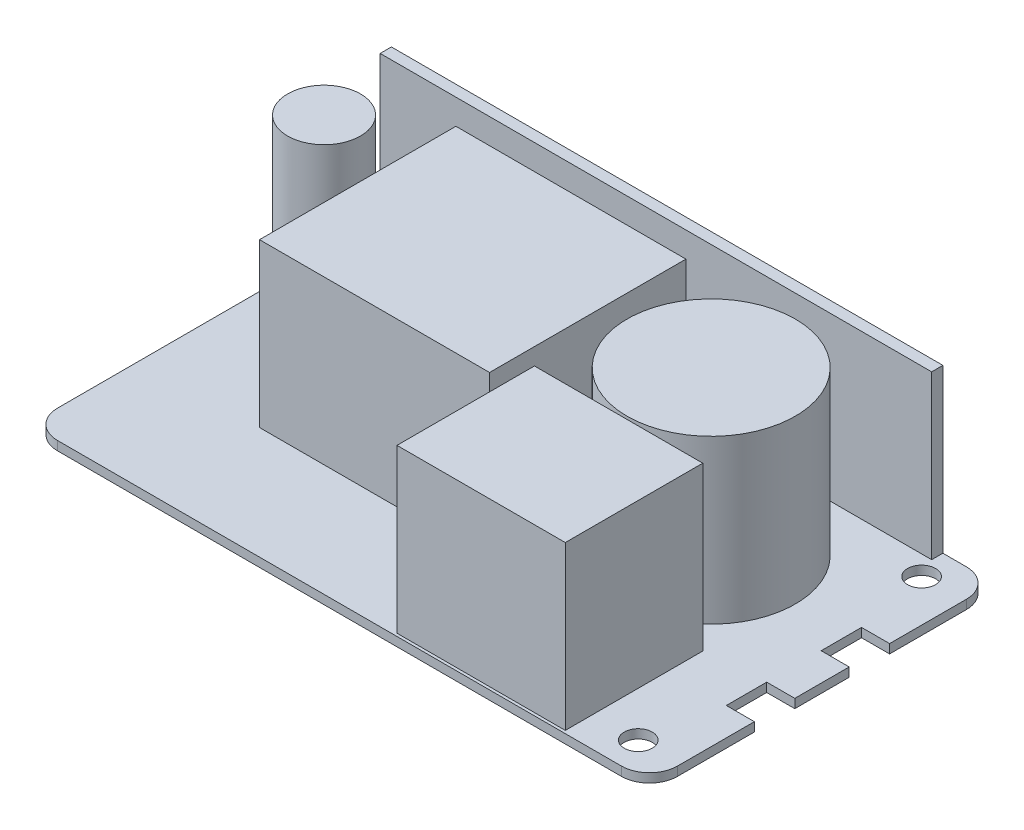
ISO-10303-21;
HEADER;
FILE_DESCRIPTION(('STEP AP214'),'2;1');
FILE_NAME('part.step','',(''),(''),'','','');
FILE_SCHEMA(('AUTOMOTIVE_DESIGN { 1 0 10303 214 1 1 1 1 }'));
ENDSEC;
DATA;
#1=APPLICATION_CONTEXT('core data for automotive mechanical design processes');
#2=APPLICATION_PROTOCOL_DEFINITION('international standard','automotive_design',2000,#1);
#3=PRODUCT_CONTEXT('',#1,'mechanical');
#4=PRODUCT('Part','Part','',(#3));
#5=PRODUCT_RELATED_PRODUCT_CATEGORY('part','',(#4));
#6=PRODUCT_DEFINITION_FORMATION('','',#4);
#7=PRODUCT_DEFINITION_CONTEXT('part definition',#1,'design');
#8=PRODUCT_DEFINITION('design','',#6,#7);
#9=PRODUCT_DEFINITION_SHAPE('','',#8);
#10=(LENGTH_UNIT() NAMED_UNIT(*) SI_UNIT(.MILLI.,.METRE.));
#11=(NAMED_UNIT(*) PLANE_ANGLE_UNIT() SI_UNIT($,.RADIAN.));
#12=(NAMED_UNIT(*) SI_UNIT($,.STERADIAN.) SOLID_ANGLE_UNIT());
#13=UNCERTAINTY_MEASURE_WITH_UNIT(LENGTH_MEASURE(1.E-05),#10,'distance_accuracy_value','');
#14=(GEOMETRIC_REPRESENTATION_CONTEXT(3) GLOBAL_UNCERTAINTY_ASSIGNED_CONTEXT((#13)) GLOBAL_UNIT_ASSIGNED_CONTEXT((#10,
#11,#12)) REPRESENTATION_CONTEXT('',''));
#15=CARTESIAN_POINT('',(0.,0.,0.));
#16=DIRECTION('',(0.,0.,1.));
#17=DIRECTION('',(1.,0.,0.));
#18=AXIS2_PLACEMENT_3D('',#15,#16,#17);
#19=CARTESIAN_POINT('',(50.25,1.6,-25.75));
#20=DIRECTION('',(0.,-1.,0.));
#21=DIRECTION('',(0.,0.,-1.));
#22=AXIS2_PLACEMENT_3D('',#19,#20,#21);
#23=PLANE('',#22);
#24=CARTESIAN_POINT('',(-47.75,1.6,-14.25));
#25=DIRECTION('',(0.,-1.,0.));
#26=DIRECTION('',(0.,0.,-1.));
#27=AXIS2_PLACEMENT_3D('',#24,#25,#26);
#28=CIRCLE('',#27,6.5);
#29=CARTESIAN_POINT('',(-47.75,1.6,-20.75));
#30=VERTEX_POINT('',#29);
#31=EDGE_CURVE('E13',#30,#30,#28,.F.);
#32=ORIENTED_EDGE('',*,*,#31,.F.);
#33=EDGE_LOOP('',(#32));
#34=FACE_BOUND('',#33,.T.);
#35=DIRECTION('',(0.,0.,-1.));
#36=VECTOR('',#35,1.);
#37=CARTESIAN_POINT('',(39.75,1.6,5.75000000000001));
#38=LINE('',#37,#36);
#39=CARTESIAN_POINT('',(39.75,1.6,30.25));
#40=VERTEX_POINT('',#39);
#41=CARTESIAN_POINT('',(39.75,1.6,5.75000000000001));
#42=VERTEX_POINT('',#41);
#43=EDGE_CURVE('E255',#40,#42,#38,.T.);
#44=ORIENTED_EDGE('',*,*,#43,.F.);
#45=DIRECTION('',(1.,0.,0.));
#46=VECTOR('',#45,1.);
#47=CARTESIAN_POINT('',(9.75000000000001,1.6,30.25));
#48=LINE('',#47,#46);
#49=CARTESIAN_POINT('',(9.75000000000001,1.6,30.25));
#50=VERTEX_POINT('',#49);
#51=EDGE_CURVE('E268',#50,#40,#48,.T.);
#52=ORIENTED_EDGE('',*,*,#51,.F.);
#53=DIRECTION('',(0.,0.,1.));
#54=VECTOR('',#53,1.);
#55=CARTESIAN_POINT('',(9.75000000000001,1.6,5.75000000000001));
#56=LINE('',#55,#54);
#57=CARTESIAN_POINT('',(9.75,1.6,5.75000000000001));
#58=VERTEX_POINT('',#57);
#59=EDGE_CURVE('E277',#58,#50,#56,.T.);
#60=ORIENTED_EDGE('',*,*,#59,.F.);
#61=DIRECTION('',(-1.,0.,0.));
#62=VECTOR('',#61,1.);
#63=CARTESIAN_POINT('',(9.75000000000001,1.6,5.75000000000001));
#64=LINE('',#63,#62);
#65=EDGE_CURVE('E258',#42,#58,#64,.T.);
#66=ORIENTED_EDGE('',*,*,#65,.F.);
#67=EDGE_LOOP('',(#44,#52,#60,#66));
#68=FACE_BOUND('',#67,.T.);
#69=CARTESIAN_POINT('',(47.75,1.6,25.25));
#70=DIRECTION('',(0.,1.,0.));
#71=DIRECTION('',(0.,0.,-1.));
#72=AXIS2_PLACEMENT_3D('',#69,#70,#71);
#73=CIRCLE('',#72,2.5);
#74=CARTESIAN_POINT('',(47.75,1.6,22.75));
#75=VERTEX_POINT('',#74);
#76=EDGE_CURVE('E328',#75,#75,#73,.T.);
#77=ORIENTED_EDGE('',*,*,#76,.F.);
#78=EDGE_LOOP('',(#77));
#79=FACE_BOUND('',#78,.T.);
#80=CARTESIAN_POINT('',(47.75,1.6,-25.25));
#81=DIRECTION('',(0.,1.,0.));
#82=DIRECTION('',(0.,0.,1.));
#83=AXIS2_PLACEMENT_3D('',#80,#81,#82);
#84=CIRCLE('',#83,2.5);
#85=CARTESIAN_POINT('',(47.75,1.6,-22.75));
#86=VERTEX_POINT('',#85);
#87=EDGE_CURVE('E333',#86,#86,#84,.T.);
#88=ORIENTED_EDGE('',*,*,#87,.F.);
#89=EDGE_LOOP('',(#88));
#90=FACE_BOUND('',#89,.T.);
#91=CARTESIAN_POINT('',(25.75,1.6,-9.74999999999999));
#92=DIRECTION('',(0.,-1.,0.));
#93=DIRECTION('',(0.,0.,-1.));
#94=AXIS2_PLACEMENT_3D('',#91,#92,#93);
#95=CIRCLE('',#94,15.);
#96=CARTESIAN_POINT('',(25.75,1.6,-24.75));
#97=VERTEX_POINT('',#96);
#98=EDGE_CURVE('E456',#97,#97,#95,.F.);
#99=ORIENTED_EDGE('',*,*,#98,.F.);
#100=EDGE_LOOP('',(#99));
#101=FACE_BOUND('',#100,.T.);
#102=DIRECTION('',(0.,0.,-1.));
#103=VECTOR('',#102,1.);
#104=CARTESIAN_POINT('',(46.05,1.6,-30.75));
#105=LINE('',#104,#103);
#106=CARTESIAN_POINT('',(46.05,1.6,-28.75));
#107=VERTEX_POINT('',#106);
#108=CARTESIAN_POINT('',(46.05,1.6,-30.75));
#109=VERTEX_POINT('',#108);
#110=EDGE_CURVE('E293',#107,#109,#105,.T.);
#111=ORIENTED_EDGE('',*,*,#110,.F.);
#112=DIRECTION('',(1.,0.,0.));
#113=VECTOR('',#112,1.);
#114=CARTESIAN_POINT('',(-52.25,1.6,-28.75));
#115=LINE('',#114,#113);
#116=CARTESIAN_POINT('',(-52.25,1.6,-28.75));
#117=VERTEX_POINT('',#116);
#118=EDGE_CURVE('E298',#117,#107,#115,.T.);
#119=ORIENTED_EDGE('',*,*,#118,.F.);
#120=DIRECTION('',(0.,0.,1.));
#121=VECTOR('',#120,1.);
#122=CARTESIAN_POINT('',(-52.25,1.6,-25.75));
#123=LINE('',#122,#121);
#124=CARTESIAN_POINT('',(-52.25,1.6,-30.3325756949558));
#125=VERTEX_POINT('',#124);
#126=EDGE_CURVE('E54',#125,#117,#123,.T.);
#127=ORIENTED_EDGE('',*,*,#126,.F.);
#128=CARTESIAN_POINT('',(-50.25,1.6,-25.75));
#129=DIRECTION('',(0.,1.,0.));
#130=DIRECTION('',(0.,0.,1.));
#131=AXIS2_PLACEMENT_3D('',#128,#129,#130);
#132=CIRCLE('',#131,5.);
#133=CARTESIAN_POINT('',(-55.25,1.6,-25.75));
#134=VERTEX_POINT('',#133);
#135=EDGE_CURVE('E347',#125,#134,#132,.T.);
#136=ORIENTED_EDGE('',*,*,#135,.T.);
#137=DIRECTION('',(0.,0.,1.));
#138=VECTOR('',#137,1.);
#139=CARTESIAN_POINT('',(-55.25,1.6,-25.75));
#140=LINE('',#139,#138);
#141=CARTESIAN_POINT('',(-55.25,1.6,25.75));
#142=VERTEX_POINT('',#141);
#143=EDGE_CURVE('E351',#134,#142,#140,.T.);
#144=ORIENTED_EDGE('',*,*,#143,.T.);
#145=CARTESIAN_POINT('',(-50.25,1.6,25.75));
#146=DIRECTION('',(0.,1.,0.));
#147=DIRECTION('',(0.,0.,1.));
#148=AXIS2_PLACEMENT_3D('',#145,#146,#147);
#149=CIRCLE('',#148,5.);
#150=CARTESIAN_POINT('',(-50.25,1.6,30.75));
#151=VERTEX_POINT('',#150);
#152=EDGE_CURVE('E353',#142,#151,#149,.T.);
#153=ORIENTED_EDGE('',*,*,#152,.T.);
#154=DIRECTION('',(1.,0.,0.));
#155=VECTOR('',#154,1.);
#156=CARTESIAN_POINT('',(-50.25,1.6,30.75));
#157=LINE('',#156,#155);
#158=CARTESIAN_POINT('',(50.25,1.6,30.75));
#159=VERTEX_POINT('',#158);
#160=EDGE_CURVE('E355',#151,#159,#157,.T.);
#161=ORIENTED_EDGE('',*,*,#160,.T.);
#162=CARTESIAN_POINT('',(50.25,1.6,25.75));
#163=DIRECTION('',(0.,1.,0.));
#164=DIRECTION('',(0.,0.,1.));
#165=AXIS2_PLACEMENT_3D('',#162,#163,#164);
#166=CIRCLE('',#165,5.);
#167=CARTESIAN_POINT('',(55.25,1.6,25.75));
#168=VERTEX_POINT('',#167);
#169=EDGE_CURVE('E357',#159,#168,#166,.T.);
#170=ORIENTED_EDGE('',*,*,#169,.T.);
#171=DIRECTION('',(0.,0.,-1.));
#172=VECTOR('',#171,1.);
#173=CARTESIAN_POINT('',(55.25,1.6,12.05));
#174=LINE('',#173,#172);
#175=CARTESIAN_POINT('',(55.25,1.6,12.05));
#176=VERTEX_POINT('',#175);
#177=EDGE_CURVE('E359',#168,#176,#174,.T.);
#178=ORIENTED_EDGE('',*,*,#177,.T.);
#179=DIRECTION('',(-1.,0.,0.));
#180=VECTOR('',#179,1.);
#181=CARTESIAN_POINT('',(55.25,1.6,12.05));
#182=LINE('',#181,#180);
#183=CARTESIAN_POINT('',(50.25,1.6,12.05));
#184=VERTEX_POINT('',#183);
#185=EDGE_CURVE('E361',#176,#184,#182,.T.);
#186=ORIENTED_EDGE('',*,*,#185,.T.);
#187=DIRECTION('',(0.,0.,-1.));
#188=VECTOR('',#187,1.);
#189=CARTESIAN_POINT('',(50.25,1.6,12.05));
#190=LINE('',#189,#188);
#191=CARTESIAN_POINT('',(50.25,1.6,4.85));
#192=VERTEX_POINT('',#191);
#193=EDGE_CURVE('E363',#184,#192,#190,.T.);
#194=ORIENTED_EDGE('',*,*,#193,.T.);
#195=DIRECTION('',(1.,0.,0.));
#196=VECTOR('',#195,1.);
#197=CARTESIAN_POINT('',(50.25,1.6,4.85));
#198=LINE('',#197,#196);
#199=CARTESIAN_POINT('',(55.25,1.6,4.85));
#200=VERTEX_POINT('',#199);
#201=EDGE_CURVE('E365',#192,#200,#198,.T.);
#202=ORIENTED_EDGE('',*,*,#201,.T.);
#203=DIRECTION('',(0.,0.,-1.));
#204=VECTOR('',#203,1.);
#205=CARTESIAN_POINT('',(55.25,1.6,-4.85));
#206=LINE('',#205,#204);
#207=CARTESIAN_POINT('',(55.25,1.6,-4.85));
#208=VERTEX_POINT('',#207);
#209=EDGE_CURVE('E367',#200,#208,#206,.T.);
#210=ORIENTED_EDGE('',*,*,#209,.T.);
#211=DIRECTION('',(-1.,0.,0.));
#212=VECTOR('',#211,1.);
#213=CARTESIAN_POINT('',(50.25,1.6,-4.85));
#214=LINE('',#213,#212);
#215=CARTESIAN_POINT('',(50.25,1.6,-4.85));
#216=VERTEX_POINT('',#215);
#217=EDGE_CURVE('E369',#208,#216,#214,.T.);
#218=ORIENTED_EDGE('',*,*,#217,.T.);
#219=DIRECTION('',(0.,0.,-1.));
#220=VECTOR('',#219,1.);
#221=CARTESIAN_POINT('',(50.25,1.6,-12.05));
#222=LINE('',#221,#220);
#223=CARTESIAN_POINT('',(50.25,1.6,-12.05));
#224=VERTEX_POINT('',#223);
#225=EDGE_CURVE('E371',#216,#224,#222,.T.);
#226=ORIENTED_EDGE('',*,*,#225,.T.);
#227=DIRECTION('',(1.,0.,0.));
#228=VECTOR('',#227,1.);
#229=CARTESIAN_POINT('',(55.25,1.6,-12.05));
#230=LINE('',#229,#228);
#231=CARTESIAN_POINT('',(55.25,1.6,-12.05));
#232=VERTEX_POINT('',#231);
#233=EDGE_CURVE('E373',#224,#232,#230,.T.);
#234=ORIENTED_EDGE('',*,*,#233,.T.);
#235=DIRECTION('',(0.,0.,-1.));
#236=VECTOR('',#235,1.);
#237=CARTESIAN_POINT('',(55.25,1.6,-25.75));
#238=LINE('',#237,#236);
#239=CARTESIAN_POINT('',(55.25,1.6,-25.75));
#240=VERTEX_POINT('',#239);
#241=EDGE_CURVE('E375',#232,#240,#238,.T.);
#242=ORIENTED_EDGE('',*,*,#241,.T.);
#243=CARTESIAN_POINT('',(50.25,1.6,-25.75));
#244=DIRECTION('',(0.,1.,0.));
#245=DIRECTION('',(0.,0.,-1.));
#246=AXIS2_PLACEMENT_3D('',#243,#244,#245);
#247=CIRCLE('',#246,4.99999999999999);
#248=CARTESIAN_POINT('',(50.25,1.6,-30.75));
#249=VERTEX_POINT('',#248);
#250=EDGE_CURVE('E341',#240,#249,#247,.T.);
#251=ORIENTED_EDGE('',*,*,#250,.T.);
#252=DIRECTION('',(-1.,0.,0.));
#253=VECTOR('',#252,1.);
#254=CARTESIAN_POINT('',(-50.25,1.6,-30.75));
#255=LINE('',#254,#253);
#256=EDGE_CURVE('E344',#249,#109,#255,.T.);
#257=ORIENTED_EDGE('',*,*,#256,.T.);
#258=EDGE_LOOP('',(#111,#119,#127,#136,#144,#153,#161,#170,#178,#186,#194,#202,#210,#218,#226,
#234,#242,#251,#257));
#259=FACE_BOUND('',#258,.T.);
#260=DIRECTION('',(0.,0.,-1.));
#261=VECTOR('',#260,1.);
#262=CARTESIAN_POINT('',(6.74999999999999,1.6,-24.25));
#263=LINE('',#262,#261);
#264=CARTESIAN_POINT('',(6.75,1.6,10.75));
#265=VERTEX_POINT('',#264);
#266=CARTESIAN_POINT('',(6.74999999999999,1.6,-24.25));
#267=VERTEX_POINT('',#266);
#268=EDGE_CURVE('E254',#265,#267,#263,.T.);
#269=ORIENTED_EDGE('',*,*,#268,.F.);
#270=DIRECTION('',(1.,0.,0.));
#271=VECTOR('',#270,1.);
#272=CARTESIAN_POINT('',(-34.25,1.6,10.75));
#273=LINE('',#272,#271);
#274=CARTESIAN_POINT('',(-34.25,1.6,10.75));
#275=VERTEX_POINT('',#274);
#276=EDGE_CURVE('E251',#275,#265,#273,.T.);
#277=ORIENTED_EDGE('',*,*,#276,.F.);
#278=DIRECTION('',(0.,0.,1.));
#279=VECTOR('',#278,1.);
#280=CARTESIAN_POINT('',(-34.25,1.6,-24.25));
#281=LINE('',#280,#279);
#282=CARTESIAN_POINT('',(-34.25,1.6,-24.25));
#283=VERTEX_POINT('',#282);
#284=EDGE_CURVE('E66',#283,#275,#281,.T.);
#285=ORIENTED_EDGE('',*,*,#284,.F.);
#286=DIRECTION('',(-1.,0.,0.));
#287=VECTOR('',#286,1.);
#288=CARTESIAN_POINT('',(-34.25,1.6,-24.25));
#289=LINE('',#288,#287);
#290=EDGE_CURVE('E61',#267,#283,#289,.T.);
#291=ORIENTED_EDGE('',*,*,#290,.F.);
#292=EDGE_LOOP('',(#269,#277,#285,#291));
#293=FACE_BOUND('',#292,.T.);
#294=ADVANCED_FACE('F46',(#34,#68,#79,#90,#101,#259,#293),#23,.F.);
#295=CARTESIAN_POINT('',(50.25,1.6,-25.75));
#296=DIRECTION('',(0.,-1.,0.));
#297=DIRECTION('',(0.,0.,-1.));
#298=AXIS2_PLACEMENT_3D('',#295,#296,#297);
#299=CYLINDRICAL_SURFACE('',#298,4.99999999999999);
#300=CARTESIAN_POINT('',(50.25,0.,-25.75));
#301=DIRECTION('',(0.,1.,0.));
#302=DIRECTION('',(0.,0.,-1.));
#303=AXIS2_PLACEMENT_3D('',#300,#301,#302);
#304=CIRCLE('',#303,4.99999999999999);
#305=CARTESIAN_POINT('',(55.25,0.,-25.75));
#306=VERTEX_POINT('',#305);
#307=CARTESIAN_POINT('',(50.25,0.,-30.75));
#308=VERTEX_POINT('',#307);
#309=EDGE_CURVE('E332',#306,#308,#304,.T.);
#310=ORIENTED_EDGE('',*,*,#309,.T.);
#311=DIRECTION('',(0.,-1.,0.));
#312=VECTOR('',#311,1.);
#313=CARTESIAN_POINT('',(50.25,1.6,-30.75));
#314=LINE('',#313,#312);
#315=EDGE_CURVE('E453',#249,#308,#314,.T.);
#316=ORIENTED_EDGE('',*,*,#315,.F.);
#317=ORIENTED_EDGE('',*,*,#250,.F.);
#318=DIRECTION('',(0.,-1.,0.));
#319=VECTOR('',#318,1.);
#320=CARTESIAN_POINT('',(55.25,1.6,-25.75));
#321=LINE('',#320,#319);
#322=EDGE_CURVE('E377',#240,#306,#321,.T.);
#323=ORIENTED_EDGE('',*,*,#322,.T.);
#324=EDGE_LOOP('',(#310,#316,#317,#323));
#325=FACE_BOUND('',#324,.T.);
#326=ADVANCED_FACE('F48',(#325),#299,.T.);
#327=CARTESIAN_POINT('',(-50.25,1.6,-30.75));
#328=DIRECTION('',(0.,0.,1.));
#329=DIRECTION('',(1.,0.,0.));
#330=AXIS2_PLACEMENT_3D('',#327,#328,#329);
#331=PLANE('',#330);
#332=DIRECTION('',(-1.,0.,0.));
#333=VECTOR('',#332,1.);
#334=CARTESIAN_POINT('',(-50.25,0.,-30.75));
#335=LINE('',#334,#333);
#336=CARTESIAN_POINT('',(-50.25,0.,-30.75));
#337=VERTEX_POINT('',#336);
#338=EDGE_CURVE('E380',#308,#337,#335,.T.);
#339=ORIENTED_EDGE('',*,*,#338,.T.);
#340=DIRECTION('',(0.,-1.,0.));
#341=VECTOR('',#340,1.);
#342=CARTESIAN_POINT('',(-50.25,1.6,-30.75));
#343=LINE('',#342,#341);
#344=CARTESIAN_POINT('',(-50.25,1.6,-30.75));
#345=VERTEX_POINT('',#344);
#346=EDGE_CURVE('E450',#345,#337,#343,.T.);
#347=ORIENTED_EDGE('',*,*,#346,.F.);
#348=DIRECTION('',(-1.,0.,0.));
#349=VECTOR('',#348,1.);
#350=CARTESIAN_POINT('',(-52.25,1.6,-30.75));
#351=LINE('',#350,#349);
#352=CARTESIAN_POINT('',(-52.25,1.6,-30.75));
#353=VERTEX_POINT('',#352);
#354=EDGE_CURVE('E307',#345,#353,#351,.T.);
#355=ORIENTED_EDGE('',*,*,#354,.T.);
#356=DIRECTION('',(0.,-1.,0.));
#357=VECTOR('',#356,1.);
#358=CARTESIAN_POINT('',(-52.25,30.6,-30.75));
#359=LINE('',#358,#357);
#360=CARTESIAN_POINT('',(-52.25,30.6,-30.75));
#361=VERTEX_POINT('',#360);
#362=EDGE_CURVE('E319',#361,#353,#359,.T.);
#363=ORIENTED_EDGE('',*,*,#362,.F.);
#364=DIRECTION('',(-1.,0.,0.));
#365=VECTOR('',#364,1.);
#366=CARTESIAN_POINT('',(-52.25,30.6,-30.75));
#367=LINE('',#366,#365);
#368=CARTESIAN_POINT('',(46.05,30.6,-30.75));
#369=VERTEX_POINT('',#368);
#370=EDGE_CURVE('E297',#369,#361,#367,.T.);
#371=ORIENTED_EDGE('',*,*,#370,.F.);
#372=DIRECTION('',(0.,-1.,0.));
#373=VECTOR('',#372,1.);
#374=CARTESIAN_POINT('',(46.05,30.6,-30.75));
#375=LINE('',#374,#373);
#376=EDGE_CURVE('E322',#369,#109,#375,.T.);
#377=ORIENTED_EDGE('',*,*,#376,.T.);
#378=ORIENTED_EDGE('',*,*,#256,.F.);
#379=ORIENTED_EDGE('',*,*,#315,.T.);
#380=EDGE_LOOP('',(#339,#347,#355,#363,#371,#377,#378,#379));
#381=FACE_BOUND('',#380,.T.);
#382=ADVANCED_FACE('F553',(#381),#331,.F.);
#383=CARTESIAN_POINT('',(-50.25,1.6,-25.75));
#384=DIRECTION('',(0.,-1.,0.));
#385=DIRECTION('',(0.,0.,-1.));
#386=AXIS2_PLACEMENT_3D('',#383,#384,#385);
#387=CYLINDRICAL_SURFACE('',#386,5.);
#388=CARTESIAN_POINT('',(-50.25,0.,-25.75));
#389=DIRECTION('',(0.,1.,0.));
#390=DIRECTION('',(0.,0.,1.));
#391=AXIS2_PLACEMENT_3D('',#388,#389,#390);
#392=CIRCLE('',#391,5.);
#393=CARTESIAN_POINT('',(-55.25,0.,-25.75));
#394=VERTEX_POINT('',#393);
#395=EDGE_CURVE('E382',#337,#394,#392,.T.);
#396=ORIENTED_EDGE('',*,*,#395,.T.);
#397=DIRECTION('',(0.,-1.,0.));
#398=VECTOR('',#397,1.);
#399=CARTESIAN_POINT('',(-55.25,1.6,-25.75));
#400=LINE('',#399,#398);
#401=EDGE_CURVE('E447',#134,#394,#400,.T.);
#402=ORIENTED_EDGE('',*,*,#401,.F.);
#403=ORIENTED_EDGE('',*,*,#135,.F.);
#404=EDGE_CURVE('E348',#345,#125,#132,.T.);
#405=ORIENTED_EDGE('',*,*,#404,.F.);
#406=ORIENTED_EDGE('',*,*,#346,.T.);
#407=EDGE_LOOP('',(#396,#402,#403,#405,#406));
#408=FACE_BOUND('',#407,.T.);
#409=ADVANCED_FACE('F481',(#408),#387,.T.);
#410=CARTESIAN_POINT('',(-55.25,1.6,-25.75));
#411=DIRECTION('',(1.,0.,0.));
#412=DIRECTION('',(0.,0.,-1.));
#413=AXIS2_PLACEMENT_3D('',#410,#411,#412);
#414=PLANE('',#413);
#415=DIRECTION('',(0.,0.,1.));
#416=VECTOR('',#415,1.);
#417=CARTESIAN_POINT('',(-55.25,0.,-25.75));
#418=LINE('',#417,#416);
#419=CARTESIAN_POINT('',(-55.25,0.,25.75));
#420=VERTEX_POINT('',#419);
#421=EDGE_CURVE('E384',#394,#420,#418,.T.);
#422=ORIENTED_EDGE('',*,*,#421,.T.);
#423=DIRECTION('',(0.,-1.,0.));
#424=VECTOR('',#423,1.);
#425=CARTESIAN_POINT('',(-55.25,1.6,25.75));
#426=LINE('',#425,#424);
#427=EDGE_CURVE('E444',#142,#420,#426,.T.);
#428=ORIENTED_EDGE('',*,*,#427,.F.);
#429=ORIENTED_EDGE('',*,*,#143,.F.);
#430=ORIENTED_EDGE('',*,*,#401,.T.);
#431=EDGE_LOOP('',(#422,#428,#429,#430));
#432=FACE_BOUND('',#431,.T.);
#433=ADVANCED_FACE('F489',(#432),#414,.F.);
#434=CARTESIAN_POINT('',(-50.25,1.6,25.75));
#435=DIRECTION('',(0.,-1.,0.));
#436=DIRECTION('',(0.,0.,-1.));
#437=AXIS2_PLACEMENT_3D('',#434,#435,#436);
#438=CYLINDRICAL_SURFACE('',#437,5.);
#439=CARTESIAN_POINT('',(-50.25,0.,25.75));
#440=DIRECTION('',(0.,1.,0.));
#441=DIRECTION('',(0.,0.,1.));
#442=AXIS2_PLACEMENT_3D('',#439,#440,#441);
#443=CIRCLE('',#442,5.);
#444=CARTESIAN_POINT('',(-50.25,0.,30.75));
#445=VERTEX_POINT('',#444);
#446=EDGE_CURVE('E386',#420,#445,#443,.T.);
#447=ORIENTED_EDGE('',*,*,#446,.T.);
#448=DIRECTION('',(0.,-1.,0.));
#449=VECTOR('',#448,1.);
#450=CARTESIAN_POINT('',(-50.25,1.6,30.75));
#451=LINE('',#450,#449);
#452=EDGE_CURVE('E441',#151,#445,#451,.T.);
#453=ORIENTED_EDGE('',*,*,#452,.F.);
#454=ORIENTED_EDGE('',*,*,#152,.F.);
#455=ORIENTED_EDGE('',*,*,#427,.T.);
#456=EDGE_LOOP('',(#447,#453,#454,#455));
#457=FACE_BOUND('',#456,.T.);
#458=ADVANCED_FACE('F493',(#457),#438,.T.);
#459=CARTESIAN_POINT('',(-50.25,1.6,30.75));
#460=DIRECTION('',(0.,0.,-1.));
#461=DIRECTION('',(-1.,0.,0.));
#462=AXIS2_PLACEMENT_3D('',#459,#460,#461);
#463=PLANE('',#462);
#464=DIRECTION('',(1.,0.,0.));
#465=VECTOR('',#464,1.);
#466=CARTESIAN_POINT('',(-50.25,0.,30.75));
#467=LINE('',#466,#465);
#468=CARTESIAN_POINT('',(50.25,0.,30.75));
#469=VERTEX_POINT('',#468);
#470=EDGE_CURVE('E388',#445,#469,#467,.T.);
#471=ORIENTED_EDGE('',*,*,#470,.T.);
#472=DIRECTION('',(0.,-1.,0.));
#473=VECTOR('',#472,1.);
#474=CARTESIAN_POINT('',(50.25,1.6,30.75));
#475=LINE('',#474,#473);
#476=EDGE_CURVE('E438',#159,#469,#475,.T.);
#477=ORIENTED_EDGE('',*,*,#476,.F.);
#478=ORIENTED_EDGE('',*,*,#160,.F.);
#479=ORIENTED_EDGE('',*,*,#452,.T.);
#480=EDGE_LOOP('',(#471,#477,#478,#479));
#481=FACE_BOUND('',#480,.T.);
#482=ADVANCED_FACE('F498',(#481),#463,.F.);
#483=CARTESIAN_POINT('',(50.25,1.6,25.75));
#484=DIRECTION('',(0.,-1.,0.));
#485=DIRECTION('',(0.,0.,-1.));
#486=AXIS2_PLACEMENT_3D('',#483,#484,#485);
#487=CYLINDRICAL_SURFACE('',#486,5.);
#488=CARTESIAN_POINT('',(50.25,0.,25.75));
#489=DIRECTION('',(0.,1.,0.));
#490=DIRECTION('',(0.,0.,1.));
#491=AXIS2_PLACEMENT_3D('',#488,#489,#490);
#492=CIRCLE('',#491,5.);
#493=CARTESIAN_POINT('',(55.25,0.,25.75));
#494=VERTEX_POINT('',#493);
#495=EDGE_CURVE('E390',#469,#494,#492,.T.);
#496=ORIENTED_EDGE('',*,*,#495,.T.);
#497=DIRECTION('',(0.,-1.,0.));
#498=VECTOR('',#497,1.);
#499=CARTESIAN_POINT('',(55.25,1.6,25.75));
#500=LINE('',#499,#498);
#501=EDGE_CURVE('E435',#168,#494,#500,.T.);
#502=ORIENTED_EDGE('',*,*,#501,.F.);
#503=ORIENTED_EDGE('',*,*,#169,.F.);
#504=ORIENTED_EDGE('',*,*,#476,.T.);
#505=EDGE_LOOP('',(#496,#502,#503,#504));
#506=FACE_BOUND('',#505,.T.);
#507=ADVANCED_FACE('F504',(#506),#487,.T.);
#508=CARTESIAN_POINT('',(55.25,1.6,12.05));
#509=DIRECTION('',(-1.,0.,0.));
#510=DIRECTION('',(0.,0.,1.));
#511=AXIS2_PLACEMENT_3D('',#508,#509,#510);
#512=PLANE('',#511);
#513=DIRECTION('',(0.,0.,-1.));
#514=VECTOR('',#513,1.);
#515=CARTESIAN_POINT('',(55.25,0.,12.05));
#516=LINE('',#515,#514);
#517=CARTESIAN_POINT('',(55.25,0.,12.05));
#518=VERTEX_POINT('',#517);
#519=EDGE_CURVE('E392',#494,#518,#516,.T.);
#520=ORIENTED_EDGE('',*,*,#519,.T.);
#521=DIRECTION('',(0.,-1.,0.));
#522=VECTOR('',#521,1.);
#523=CARTESIAN_POINT('',(55.25,1.6,12.05));
#524=LINE('',#523,#522);
#525=EDGE_CURVE('E432',#176,#518,#524,.T.);
#526=ORIENTED_EDGE('',*,*,#525,.F.);
#527=ORIENTED_EDGE('',*,*,#177,.F.);
#528=ORIENTED_EDGE('',*,*,#501,.T.);
#529=EDGE_LOOP('',(#520,#526,#527,#528));
#530=FACE_BOUND('',#529,.T.);
#531=ADVANCED_FACE('F508',(#530),#512,.F.);
#532=CARTESIAN_POINT('',(55.25,1.6,12.05));
#533=DIRECTION('',(0.,0.,1.));
#534=DIRECTION('',(1.,0.,0.));
#535=AXIS2_PLACEMENT_3D('',#532,#533,#534);
#536=PLANE('',#535);
#537=DIRECTION('',(-1.,0.,0.));
#538=VECTOR('',#537,1.);
#539=CARTESIAN_POINT('',(55.25,0.,12.05));
#540=LINE('',#539,#538);
#541=CARTESIAN_POINT('',(50.25,0.,12.05));
#542=VERTEX_POINT('',#541);
#543=EDGE_CURVE('E394',#518,#542,#540,.T.);
#544=ORIENTED_EDGE('',*,*,#543,.T.);
#545=DIRECTION('',(0.,-1.,0.));
#546=VECTOR('',#545,1.);
#547=CARTESIAN_POINT('',(50.25,1.6,12.05));
#548=LINE('',#547,#546);
#549=EDGE_CURVE('E429',#184,#542,#548,.T.);
#550=ORIENTED_EDGE('',*,*,#549,.F.);
#551=ORIENTED_EDGE('',*,*,#185,.F.);
#552=ORIENTED_EDGE('',*,*,#525,.T.);
#553=EDGE_LOOP('',(#544,#550,#551,#552));
#554=FACE_BOUND('',#553,.T.);
#555=ADVANCED_FACE('F513',(#554),#536,.F.);
#556=CARTESIAN_POINT('',(50.25,1.6,12.05));
#557=DIRECTION('',(-1.,0.,0.));
#558=DIRECTION('',(0.,0.,1.));
#559=AXIS2_PLACEMENT_3D('',#556,#557,#558);
#560=PLANE('',#559);
#561=DIRECTION('',(0.,0.,-1.));
#562=VECTOR('',#561,1.);
#563=CARTESIAN_POINT('',(50.25,0.,12.05));
#564=LINE('',#563,#562);
#565=CARTESIAN_POINT('',(50.25,0.,4.85));
#566=VERTEX_POINT('',#565);
#567=EDGE_CURVE('E396',#542,#566,#564,.T.);
#568=ORIENTED_EDGE('',*,*,#567,.T.);
#569=DIRECTION('',(0.,-1.,0.));
#570=VECTOR('',#569,1.);
#571=CARTESIAN_POINT('',(50.25,1.6,4.85));
#572=LINE('',#571,#570);
#573=EDGE_CURVE('E426',#192,#566,#572,.T.);
#574=ORIENTED_EDGE('',*,*,#573,.F.);
#575=ORIENTED_EDGE('',*,*,#193,.F.);
#576=ORIENTED_EDGE('',*,*,#549,.T.);
#577=EDGE_LOOP('',(#568,#574,#575,#576));
#578=FACE_BOUND('',#577,.T.);
#579=ADVANCED_FACE('F519',(#578),#560,.F.);
#580=CARTESIAN_POINT('',(50.25,1.6,4.85));
#581=DIRECTION('',(0.,0.,-1.));
#582=DIRECTION('',(-1.,0.,0.));
#583=AXIS2_PLACEMENT_3D('',#580,#581,#582);
#584=PLANE('',#583);
#585=DIRECTION('',(1.,0.,0.));
#586=VECTOR('',#585,1.);
#587=CARTESIAN_POINT('',(50.25,0.,4.85));
#588=LINE('',#587,#586);
#589=CARTESIAN_POINT('',(55.25,0.,4.85));
#590=VERTEX_POINT('',#589);
#591=EDGE_CURVE('E398',#566,#590,#588,.T.);
#592=ORIENTED_EDGE('',*,*,#591,.T.);
#593=DIRECTION('',(0.,-1.,0.));
#594=VECTOR('',#593,1.);
#595=CARTESIAN_POINT('',(55.25,1.6,4.85));
#596=LINE('',#595,#594);
#597=EDGE_CURVE('E423',#200,#590,#596,.T.);
#598=ORIENTED_EDGE('',*,*,#597,.F.);
#599=ORIENTED_EDGE('',*,*,#201,.F.);
#600=ORIENTED_EDGE('',*,*,#573,.T.);
#601=EDGE_LOOP('',(#592,#598,#599,#600));
#602=FACE_BOUND('',#601,.T.);
#603=ADVANCED_FACE('F523',(#602),#584,.F.);
#604=CARTESIAN_POINT('',(55.25,1.6,-4.85));
#605=DIRECTION('',(-1.,0.,0.));
#606=DIRECTION('',(0.,0.,1.));
#607=AXIS2_PLACEMENT_3D('',#604,#605,#606);
#608=PLANE('',#607);
#609=DIRECTION('',(0.,0.,-1.));
#610=VECTOR('',#609,1.);
#611=CARTESIAN_POINT('',(55.25,0.,-4.85));
#612=LINE('',#611,#610);
#613=CARTESIAN_POINT('',(55.25,0.,-4.85));
#614=VERTEX_POINT('',#613);
#615=EDGE_CURVE('E400',#590,#614,#612,.T.);
#616=ORIENTED_EDGE('',*,*,#615,.T.);
#617=DIRECTION('',(0.,-1.,0.));
#618=VECTOR('',#617,1.);
#619=CARTESIAN_POINT('',(55.25,1.6,-4.85));
#620=LINE('',#619,#618);
#621=EDGE_CURVE('E420',#208,#614,#620,.T.);
#622=ORIENTED_EDGE('',*,*,#621,.F.);
#623=ORIENTED_EDGE('',*,*,#209,.F.);
#624=ORIENTED_EDGE('',*,*,#597,.T.);
#625=EDGE_LOOP('',(#616,#622,#623,#624));
#626=FACE_BOUND('',#625,.T.);
#627=ADVANCED_FACE('F528',(#626),#608,.F.);
#628=CARTESIAN_POINT('',(50.25,1.6,-4.85));
#629=DIRECTION('',(0.,0.,1.));
#630=DIRECTION('',(1.,0.,0.));
#631=AXIS2_PLACEMENT_3D('',#628,#629,#630);
#632=PLANE('',#631);
#633=DIRECTION('',(-1.,0.,0.));
#634=VECTOR('',#633,1.);
#635=CARTESIAN_POINT('',(50.25,0.,-4.85));
#636=LINE('',#635,#634);
#637=CARTESIAN_POINT('',(50.25,0.,-4.85));
#638=VERTEX_POINT('',#637);
#639=EDGE_CURVE('E402',#614,#638,#636,.T.);
#640=ORIENTED_EDGE('',*,*,#639,.T.);
#641=DIRECTION('',(0.,-1.,0.));
#642=VECTOR('',#641,1.);
#643=CARTESIAN_POINT('',(50.25,1.6,-4.85));
#644=LINE('',#643,#642);
#645=EDGE_CURVE('E417',#216,#638,#644,.T.);
#646=ORIENTED_EDGE('',*,*,#645,.F.);
#647=ORIENTED_EDGE('',*,*,#217,.F.);
#648=ORIENTED_EDGE('',*,*,#621,.T.);
#649=EDGE_LOOP('',(#640,#646,#647,#648));
#650=FACE_BOUND('',#649,.T.);
#651=ADVANCED_FACE('F534',(#650),#632,.F.);
#652=CARTESIAN_POINT('',(50.25,1.6,-12.05));
#653=DIRECTION('',(-1.,0.,0.));
#654=DIRECTION('',(0.,0.,1.));
#655=AXIS2_PLACEMENT_3D('',#652,#653,#654);
#656=PLANE('',#655);
#657=DIRECTION('',(0.,0.,-1.));
#658=VECTOR('',#657,1.);
#659=CARTESIAN_POINT('',(50.25,0.,-12.05));
#660=LINE('',#659,#658);
#661=CARTESIAN_POINT('',(50.25,0.,-12.05));
#662=VERTEX_POINT('',#661);
#663=EDGE_CURVE('E404',#638,#662,#660,.T.);
#664=ORIENTED_EDGE('',*,*,#663,.T.);
#665=DIRECTION('',(0.,-1.,0.));
#666=VECTOR('',#665,1.);
#667=CARTESIAN_POINT('',(50.25,1.6,-12.05));
#668=LINE('',#667,#666);
#669=EDGE_CURVE('E414',#224,#662,#668,.T.);
#670=ORIENTED_EDGE('',*,*,#669,.F.);
#671=ORIENTED_EDGE('',*,*,#225,.F.);
#672=ORIENTED_EDGE('',*,*,#645,.T.);
#673=EDGE_LOOP('',(#664,#670,#671,#672));
#674=FACE_BOUND('',#673,.T.);
#675=ADVANCED_FACE('F538',(#674),#656,.F.);
#676=CARTESIAN_POINT('',(55.25,1.6,-12.05));
#677=DIRECTION('',(0.,0.,-1.));
#678=DIRECTION('',(-1.,0.,0.));
#679=AXIS2_PLACEMENT_3D('',#676,#677,#678);
#680=PLANE('',#679);
#681=DIRECTION('',(1.,0.,0.));
#682=VECTOR('',#681,1.);
#683=CARTESIAN_POINT('',(55.25,0.,-12.05));
#684=LINE('',#683,#682);
#685=CARTESIAN_POINT('',(55.25,0.,-12.05));
#686=VERTEX_POINT('',#685);
#687=EDGE_CURVE('E406',#662,#686,#684,.T.);
#688=ORIENTED_EDGE('',*,*,#687,.T.);
#689=DIRECTION('',(0.,-1.,0.));
#690=VECTOR('',#689,1.);
#691=CARTESIAN_POINT('',(55.25,1.6,-12.05));
#692=LINE('',#691,#690);
#693=EDGE_CURVE('E411',#232,#686,#692,.T.);
#694=ORIENTED_EDGE('',*,*,#693,.F.);
#695=ORIENTED_EDGE('',*,*,#233,.F.);
#696=ORIENTED_EDGE('',*,*,#669,.T.);
#697=EDGE_LOOP('',(#688,#694,#695,#696));
#698=FACE_BOUND('',#697,.T.);
#699=ADVANCED_FACE('F543',(#698),#680,.F.);
#700=CARTESIAN_POINT('',(55.25,1.6,-25.75));
#701=DIRECTION('',(-1.,0.,0.));
#702=DIRECTION('',(0.,0.,1.));
#703=AXIS2_PLACEMENT_3D('',#700,#701,#702);
#704=PLANE('',#703);
#705=DIRECTION('',(0.,0.,-1.));
#706=VECTOR('',#705,1.);
#707=CARTESIAN_POINT('',(55.25,0.,-25.75));
#708=LINE('',#707,#706);
#709=EDGE_CURVE('E345',#686,#306,#708,.T.);
#710=ORIENTED_EDGE('',*,*,#709,.T.);
#711=ORIENTED_EDGE('',*,*,#322,.F.);
#712=ORIENTED_EDGE('',*,*,#241,.F.);
#713=ORIENTED_EDGE('',*,*,#693,.T.);
#714=EDGE_LOOP('',(#710,#711,#712,#713));
#715=FACE_BOUND('',#714,.T.);
#716=ADVANCED_FACE('F549',(#715),#704,.F.);
#717=CARTESIAN_POINT('',(50.25,0.,-25.75));
#718=DIRECTION('',(0.,-1.,0.));
#719=DIRECTION('',(0.,0.,-1.));
#720=AXIS2_PLACEMENT_3D('',#717,#718,#719);
#721=PLANE('',#720);
#722=CARTESIAN_POINT('',(47.75,0.,-25.25));
#723=DIRECTION('',(0.,1.,0.));
#724=DIRECTION('',(0.,0.,1.));
#725=AXIS2_PLACEMENT_3D('',#722,#723,#724);
#726=CIRCLE('',#725,2.5);
#727=CARTESIAN_POINT('',(47.75,0.,-22.75));
#728=VERTEX_POINT('',#727);
#729=EDGE_CURVE('E329',#728,#728,#726,.T.);
#730=ORIENTED_EDGE('',*,*,#729,.T.);
#731=EDGE_LOOP('',(#730));
#732=FACE_BOUND('',#731,.T.);
#733=CARTESIAN_POINT('',(47.75,0.,25.25));
#734=DIRECTION('',(0.,1.,0.));
#735=DIRECTION('',(0.,0.,-1.));
#736=AXIS2_PLACEMENT_3D('',#733,#734,#735);
#737=CIRCLE('',#736,2.5);
#738=CARTESIAN_POINT('',(47.75,0.,22.75));
#739=VERTEX_POINT('',#738);
#740=EDGE_CURVE('E336',#739,#739,#737,.T.);
#741=ORIENTED_EDGE('',*,*,#740,.T.);
#742=EDGE_LOOP('',(#741));
#743=FACE_BOUND('',#742,.T.);
#744=ORIENTED_EDGE('',*,*,#309,.F.);
#745=ORIENTED_EDGE('',*,*,#709,.F.);
#746=ORIENTED_EDGE('',*,*,#687,.F.);
#747=ORIENTED_EDGE('',*,*,#663,.F.);
#748=ORIENTED_EDGE('',*,*,#639,.F.);
#749=ORIENTED_EDGE('',*,*,#615,.F.);
#750=ORIENTED_EDGE('',*,*,#591,.F.);
#751=ORIENTED_EDGE('',*,*,#567,.F.);
#752=ORIENTED_EDGE('',*,*,#543,.F.);
#753=ORIENTED_EDGE('',*,*,#519,.F.);
#754=ORIENTED_EDGE('',*,*,#495,.F.);
#755=ORIENTED_EDGE('',*,*,#470,.F.);
#756=ORIENTED_EDGE('',*,*,#446,.F.);
#757=ORIENTED_EDGE('',*,*,#421,.F.);
#758=ORIENTED_EDGE('',*,*,#395,.F.);
#759=ORIENTED_EDGE('',*,*,#338,.F.);
#760=EDGE_LOOP('',(#744,#745,#746,#747,#748,#749,#750,#751,#752,#753,#754,#755,#756,#757,#758,#759));
#761=FACE_BOUND('',#760,.T.);
#762=ADVANCED_FACE('F579',(#732,#743,#761),#721,.T.);
#763=CARTESIAN_POINT('',(47.75,0.,25.25));
#764=DIRECTION('',(0.,1.,0.));
#765=DIRECTION('',(0.,0.,1.));
#766=AXIS2_PLACEMENT_3D('',#763,#764,#765);
#767=CYLINDRICAL_SURFACE('',#766,2.5);
#768=ORIENTED_EDGE('',*,*,#740,.F.);
#769=EDGE_LOOP('',(#768));
#770=FACE_BOUND('',#769,.T.);
#771=ORIENTED_EDGE('',*,*,#76,.T.);
#772=EDGE_LOOP('',(#771));
#773=FACE_BOUND('',#772,.T.);
#774=ADVANCED_FACE('F577',(#770,#773),#767,.F.);
#775=CARTESIAN_POINT('',(47.75,0.,-25.25));
#776=DIRECTION('',(0.,1.,0.));
#777=DIRECTION('',(0.,0.,1.));
#778=AXIS2_PLACEMENT_3D('',#775,#776,#777);
#779=CYLINDRICAL_SURFACE('',#778,2.5);
#780=ORIENTED_EDGE('',*,*,#729,.F.);
#781=EDGE_LOOP('',(#780));
#782=FACE_BOUND('',#781,.T.);
#783=ORIENTED_EDGE('',*,*,#87,.T.);
#784=EDGE_LOOP('',(#783));
#785=FACE_BOUND('',#784,.T.);
#786=ADVANCED_FACE('F682',(#782,#785),#779,.F.);
#787=CARTESIAN_POINT('',(25.75,30.6,-9.74999999999999));
#788=DIRECTION('',(0.,-1.,0.));
#789=DIRECTION('',(0.,0.,-1.));
#790=AXIS2_PLACEMENT_3D('',#787,#788,#789);
#791=CYLINDRICAL_SURFACE('',#790,15.);
#792=CARTESIAN_POINT('',(25.75,30.6,-9.74999999999999));
#793=DIRECTION('',(0.,1.,0.));
#794=DIRECTION('',(0.,0.,1.));
#795=AXIS2_PLACEMENT_3D('',#792,#793,#794);
#796=CIRCLE('',#795,15.);
#797=CARTESIAN_POINT('',(25.75,30.6,5.25));
#798=VERTEX_POINT('',#797);
#799=EDGE_CURVE('E325',#798,#798,#796,.T.);
#800=ORIENTED_EDGE('',*,*,#799,.F.);
#801=EDGE_LOOP('',(#800));
#802=FACE_BOUND('',#801,.T.);
#803=ORIENTED_EDGE('',*,*,#98,.T.);
#804=EDGE_LOOP('',(#803));
#805=FACE_BOUND('',#804,.T.);
#806=ADVANCED_FACE('F564',(#802,#805),#791,.T.);
#807=CARTESIAN_POINT('',(25.75,30.6,-9.74999999999999));
#808=DIRECTION('',(0.,1.,0.));
#809=DIRECTION('',(0.,0.,1.));
#810=AXIS2_PLACEMENT_3D('',#807,#808,#809);
#811=PLANE('',#810);
#812=ORIENTED_EDGE('',*,*,#799,.T.);
#813=EDGE_LOOP('',(#812));
#814=FACE_BOUND('',#813,.T.);
#815=ADVANCED_FACE('F557',(#814),#811,.T.);
#816=CARTESIAN_POINT('',(46.05,30.6,-30.75));
#817=DIRECTION('',(-1.,0.,0.));
#818=DIRECTION('',(0.,0.,1.));
#819=AXIS2_PLACEMENT_3D('',#816,#817,#818);
#820=PLANE('',#819);
#821=ORIENTED_EDGE('',*,*,#110,.T.);
#822=ORIENTED_EDGE('',*,*,#376,.F.);
#823=DIRECTION('',(0.,0.,-1.));
#824=VECTOR('',#823,1.);
#825=CARTESIAN_POINT('',(46.05,30.6,-30.75));
#826=LINE('',#825,#824);
#827=CARTESIAN_POINT('',(46.05,30.6,-28.75));
#828=VERTEX_POINT('',#827);
#829=EDGE_CURVE('E294',#828,#369,#826,.T.);
#830=ORIENTED_EDGE('',*,*,#829,.F.);
#831=DIRECTION('',(0.,-1.,0.));
#832=VECTOR('',#831,1.);
#833=CARTESIAN_POINT('',(46.05,30.6,-28.75));
#834=LINE('',#833,#832);
#835=EDGE_CURVE('E304',#828,#107,#834,.T.);
#836=ORIENTED_EDGE('',*,*,#835,.T.);
#837=EDGE_LOOP('',(#821,#822,#830,#836));
#838=FACE_BOUND('',#837,.T.);
#839=ADVANCED_FACE('F555',(#838),#820,.F.);
#840=CARTESIAN_POINT('',(-52.25,30.6,-30.75));
#841=DIRECTION('',(1.,0.,0.));
#842=DIRECTION('',(0.,0.,-1.));
#843=AXIS2_PLACEMENT_3D('',#840,#841,#842);
#844=PLANE('',#843);
#845=DIRECTION('',(0.,0.,1.));
#846=VECTOR('',#845,1.);
#847=CARTESIAN_POINT('',(-52.25,1.6,-30.75));
#848=LINE('',#847,#846);
#849=EDGE_CURVE('E309',#353,#125,#848,.T.);
#850=ORIENTED_EDGE('',*,*,#849,.T.);
#851=ORIENTED_EDGE('',*,*,#126,.T.);
#852=DIRECTION('',(0.,-1.,0.));
#853=VECTOR('',#852,1.);
#854=CARTESIAN_POINT('',(-52.25,30.6,-28.75));
#855=LINE('',#854,#853);
#856=CARTESIAN_POINT('',(-52.25,30.6,-28.75));
#857=VERTEX_POINT('',#856);
#858=EDGE_CURVE('E316',#857,#117,#855,.T.);
#859=ORIENTED_EDGE('',*,*,#858,.F.);
#860=DIRECTION('',(0.,0.,1.));
#861=VECTOR('',#860,1.);
#862=CARTESIAN_POINT('',(-52.25,30.6,-30.75));
#863=LINE('',#862,#861);
#864=EDGE_CURVE('E300',#361,#857,#863,.T.);
#865=ORIENTED_EDGE('',*,*,#864,.F.);
#866=ORIENTED_EDGE('',*,*,#362,.T.);
#867=EDGE_LOOP('',(#850,#851,#859,#865,#866));
#868=FACE_BOUND('',#867,.T.);
#869=ADVANCED_FACE('F461',(#868),#844,.F.);
#870=CARTESIAN_POINT('',(-52.25,30.6,-28.75));
#871=DIRECTION('',(0.,0.,-1.));
#872=DIRECTION('',(-1.,0.,0.));
#873=AXIS2_PLACEMENT_3D('',#870,#871,#872);
#874=PLANE('',#873);
#875=ORIENTED_EDGE('',*,*,#118,.T.);
#876=ORIENTED_EDGE('',*,*,#835,.F.);
#877=DIRECTION('',(1.,0.,0.));
#878=VECTOR('',#877,1.);
#879=CARTESIAN_POINT('',(-52.25,30.6,-28.75));
#880=LINE('',#879,#878);
#881=EDGE_CURVE('E302',#857,#828,#880,.T.);
#882=ORIENTED_EDGE('',*,*,#881,.F.);
#883=ORIENTED_EDGE('',*,*,#858,.T.);
#884=EDGE_LOOP('',(#875,#876,#882,#883));
#885=FACE_BOUND('',#884,.T.);
#886=ADVANCED_FACE('F468',(#885),#874,.F.);
#887=CARTESIAN_POINT('',(0.,30.6,0.));
#888=DIRECTION('',(0.,1.,0.));
#889=DIRECTION('',(0.,0.,1.));
#890=AXIS2_PLACEMENT_3D('',#887,#888,#889);
#891=PLANE('',#890);
#892=ORIENTED_EDGE('',*,*,#829,.T.);
#893=ORIENTED_EDGE('',*,*,#370,.T.);
#894=ORIENTED_EDGE('',*,*,#864,.T.);
#895=ORIENTED_EDGE('',*,*,#881,.T.);
#896=EDGE_LOOP('',(#892,#893,#894,#895));
#897=FACE_BOUND('',#896,.T.);
#898=ADVANCED_FACE('F472',(#897),#891,.T.);
#899=CARTESIAN_POINT('',(0.,1.6,0.));
#900=DIRECTION('',(0.,1.,0.));
#901=DIRECTION('',(0.,0.,1.));
#902=AXIS2_PLACEMENT_3D('',#899,#900,#901);
#903=PLANE('',#902);
#904=ORIENTED_EDGE('',*,*,#354,.F.);
#905=ORIENTED_EDGE('',*,*,#404,.T.);
#906=ORIENTED_EDGE('',*,*,#849,.F.);
#907=EDGE_LOOP('',(#904,#905,#906));
#908=FACE_BOUND('',#907,.T.);
#909=ADVANCED_FACE('F478',(#908),#903,.F.);
#910=CARTESIAN_POINT('',(39.75,30.6,5.75000000000001));
#911=DIRECTION('',(-1.,0.,0.));
#912=DIRECTION('',(0.,0.,1.));
#913=AXIS2_PLACEMENT_3D('',#910,#911,#912);
#914=PLANE('',#913);
#915=ORIENTED_EDGE('',*,*,#43,.T.);
#916=DIRECTION('',(0.,-1.,0.));
#917=VECTOR('',#916,1.);
#918=CARTESIAN_POINT('',(39.75,30.6,5.75000000000001));
#919=LINE('',#918,#917);
#920=CARTESIAN_POINT('',(39.75,30.6,5.75000000000001));
#921=VERTEX_POINT('',#920);
#922=EDGE_CURVE('E290',#921,#42,#919,.T.);
#923=ORIENTED_EDGE('',*,*,#922,.F.);
#924=DIRECTION('',(0.,0.,-1.));
#925=VECTOR('',#924,1.);
#926=CARTESIAN_POINT('',(39.75,30.6,5.75000000000001));
#927=LINE('',#926,#925);
#928=CARTESIAN_POINT('',(39.75,30.6,30.25));
#929=VERTEX_POINT('',#928);
#930=EDGE_CURVE('E264',#929,#921,#927,.T.);
#931=ORIENTED_EDGE('',*,*,#930,.F.);
#932=DIRECTION('',(0.,-1.,0.));
#933=VECTOR('',#932,1.);
#934=CARTESIAN_POINT('',(39.75,30.6,30.25));
#935=LINE('',#934,#933);
#936=EDGE_CURVE('E273',#929,#40,#935,.T.);
#937=ORIENTED_EDGE('',*,*,#936,.T.);
#938=EDGE_LOOP('',(#915,#923,#931,#937));
#939=FACE_BOUND('',#938,.T.);
#940=ADVANCED_FACE('F734',(#939),#914,.F.);
#941=CARTESIAN_POINT('',(9.75000000000001,30.6,5.75000000000001));
#942=DIRECTION('',(0.,0.,1.));
#943=DIRECTION('',(1.,0.,0.));
#944=AXIS2_PLACEMENT_3D('',#941,#942,#943);
#945=PLANE('',#944);
#946=ORIENTED_EDGE('',*,*,#65,.T.);
#947=DIRECTION('',(0.,-1.,0.));
#948=VECTOR('',#947,1.);
#949=CARTESIAN_POINT('',(9.75000000000001,30.6,5.75000000000001));
#950=LINE('',#949,#948);
#951=CARTESIAN_POINT('',(9.75000000000001,30.6,5.75000000000001));
#952=VERTEX_POINT('',#951);
#953=EDGE_CURVE('E287',#952,#58,#950,.T.);
#954=ORIENTED_EDGE('',*,*,#953,.F.);
#955=DIRECTION('',(-1.,0.,0.));
#956=VECTOR('',#955,1.);
#957=CARTESIAN_POINT('',(9.75000000000001,30.6,5.75000000000001));
#958=LINE('',#957,#956);
#959=EDGE_CURVE('E267',#921,#952,#958,.T.);
#960=ORIENTED_EDGE('',*,*,#959,.F.);
#961=ORIENTED_EDGE('',*,*,#922,.T.);
#962=EDGE_LOOP('',(#946,#954,#960,#961));
#963=FACE_BOUND('',#962,.T.);
#964=ADVANCED_FACE('F743',(#963),#945,.F.);
#965=CARTESIAN_POINT('',(9.75000000000001,30.6,5.75000000000001));
#966=DIRECTION('',(1.,0.,0.));
#967=DIRECTION('',(0.,0.,-1.));
#968=AXIS2_PLACEMENT_3D('',#965,#966,#967);
#969=PLANE('',#968);
#970=ORIENTED_EDGE('',*,*,#59,.T.);
#971=DIRECTION('',(0.,-1.,0.));
#972=VECTOR('',#971,1.);
#973=CARTESIAN_POINT('',(9.75000000000001,30.6,30.25));
#974=LINE('',#973,#972);
#975=CARTESIAN_POINT('',(9.75000000000001,30.6,30.25));
#976=VERTEX_POINT('',#975);
#977=EDGE_CURVE('E284',#976,#50,#974,.T.);
#978=ORIENTED_EDGE('',*,*,#977,.F.);
#979=DIRECTION('',(0.,0.,1.));
#980=VECTOR('',#979,1.);
#981=CARTESIAN_POINT('',(9.75000000000001,30.6,5.75000000000001));
#982=LINE('',#981,#980);
#983=EDGE_CURVE('E270',#952,#976,#982,.T.);
#984=ORIENTED_EDGE('',*,*,#983,.F.);
#985=ORIENTED_EDGE('',*,*,#953,.T.);
#986=EDGE_LOOP('',(#970,#978,#984,#985));
#987=FACE_BOUND('',#986,.T.);
#988=ADVANCED_FACE('F753',(#987),#969,.F.);
#989=CARTESIAN_POINT('',(9.75000000000001,30.6,30.25));
#990=DIRECTION('',(0.,0.,-1.));
#991=DIRECTION('',(-1.,0.,0.));
#992=AXIS2_PLACEMENT_3D('',#989,#990,#991);
#993=PLANE('',#992);
#994=ORIENTED_EDGE('',*,*,#51,.T.);
#995=ORIENTED_EDGE('',*,*,#936,.F.);
#996=DIRECTION('',(1.,0.,0.));
#997=VECTOR('',#996,1.);
#998=CARTESIAN_POINT('',(9.75000000000001,30.6,30.25));
#999=LINE('',#998,#997);
#1000=EDGE_CURVE('E272',#976,#929,#999,.T.);
#1001=ORIENTED_EDGE('',*,*,#1000,.F.);
#1002=ORIENTED_EDGE('',*,*,#977,.T.);
#1003=EDGE_LOOP('',(#994,#995,#1001,#1002));
#1004=FACE_BOUND('',#1003,.T.);
#1005=ADVANCED_FACE('F763',(#1004),#993,.F.);
#1006=CARTESIAN_POINT('',(0.,30.6,0.));
#1007=DIRECTION('',(0.,1.,0.));
#1008=DIRECTION('',(0.,0.,1.));
#1009=AXIS2_PLACEMENT_3D('',#1006,#1007,#1008);
#1010=PLANE('',#1009);
#1011=ORIENTED_EDGE('',*,*,#930,.T.);
#1012=ORIENTED_EDGE('',*,*,#959,.T.);
#1013=ORIENTED_EDGE('',*,*,#983,.T.);
#1014=ORIENTED_EDGE('',*,*,#1000,.T.);
#1015=EDGE_LOOP('',(#1011,#1012,#1013,#1014));
#1016=FACE_BOUND('',#1015,.T.);
#1017=ADVANCED_FACE('F773',(#1016),#1010,.T.);
#1018=CARTESIAN_POINT('',(6.74999999999999,30.6,-24.25));
#1019=DIRECTION('',(-1.,0.,0.));
#1020=DIRECTION('',(0.,0.,1.));
#1021=AXIS2_PLACEMENT_3D('',#1018,#1019,#1020);
#1022=PLANE('',#1021);
#1023=ORIENTED_EDGE('',*,*,#268,.T.);
#1024=DIRECTION('',(0.,-1.,0.));
#1025=VECTOR('',#1024,1.);
#1026=CARTESIAN_POINT('',(6.74999999999999,30.6,-24.25));
#1027=LINE('',#1026,#1025);
#1028=CARTESIAN_POINT('',(6.74999999999999,30.6,-24.25));
#1029=VERTEX_POINT('',#1028);
#1030=EDGE_CURVE('E235',#1029,#267,#1027,.T.);
#1031=ORIENTED_EDGE('',*,*,#1030,.F.);
#1032=DIRECTION('',(0.,0.,-1.));
#1033=VECTOR('',#1032,1.);
#1034=CARTESIAN_POINT('',(6.74999999999999,30.6,-24.25));
#1035=LINE('',#1034,#1033);
#1036=CARTESIAN_POINT('',(6.75,30.6,10.75));
#1037=VERTEX_POINT('',#1036);
#1038=EDGE_CURVE('E242',#1037,#1029,#1035,.T.);
#1039=ORIENTED_EDGE('',*,*,#1038,.F.);
#1040=DIRECTION('',(0.,-1.,0.));
#1041=VECTOR('',#1040,1.);
#1042=CARTESIAN_POINT('',(6.75,30.6,10.75));
#1043=LINE('',#1042,#1041);
#1044=EDGE_CURVE('E858',#1037,#265,#1043,.T.);
#1045=ORIENTED_EDGE('',*,*,#1044,.T.);
#1046=EDGE_LOOP('',(#1023,#1031,#1039,#1045));
#1047=FACE_BOUND('',#1046,.T.);
#1048=ADVANCED_FACE('F253',(#1047),#1022,.F.);
#1049=CARTESIAN_POINT('',(-34.25,30.6,-24.25));
#1050=DIRECTION('',(0.,0.,1.));
#1051=DIRECTION('',(1.,0.,0.));
#1052=AXIS2_PLACEMENT_3D('',#1049,#1050,#1051);
#1053=PLANE('',#1052);
#1054=ORIENTED_EDGE('',*,*,#290,.T.);
#1055=DIRECTION('',(0.,-1.,0.));
#1056=VECTOR('',#1055,1.);
#1057=CARTESIAN_POINT('',(-34.25,30.6,-24.25));
#1058=LINE('',#1057,#1056);
#1059=CARTESIAN_POINT('',(-34.25,30.6,-24.25));
#1060=VERTEX_POINT('',#1059);
#1061=EDGE_CURVE('E238',#1060,#283,#1058,.T.);
#1062=ORIENTED_EDGE('',*,*,#1061,.F.);
#1063=DIRECTION('',(-1.,0.,0.));
#1064=VECTOR('',#1063,1.);
#1065=CARTESIAN_POINT('',(-34.25,30.6,-24.25));
#1066=LINE('',#1065,#1064);
#1067=EDGE_CURVE('E231',#1029,#1060,#1066,.T.);
#1068=ORIENTED_EDGE('',*,*,#1067,.F.);
#1069=ORIENTED_EDGE('',*,*,#1030,.T.);
#1070=EDGE_LOOP('',(#1054,#1062,#1068,#1069));
#1071=FACE_BOUND('',#1070,.T.);
#1072=ADVANCED_FACE('F233',(#1071),#1053,.F.);
#1073=CARTESIAN_POINT('',(-34.25,30.6,-24.25));
#1074=DIRECTION('',(1.,0.,0.));
#1075=DIRECTION('',(0.,0.,-1.));
#1076=AXIS2_PLACEMENT_3D('',#1073,#1074,#1075);
#1077=PLANE('',#1076);
#1078=ORIENTED_EDGE('',*,*,#284,.T.);
#1079=DIRECTION('',(0.,-1.,0.));
#1080=VECTOR('',#1079,1.);
#1081=CARTESIAN_POINT('',(-34.25,30.6,10.75));
#1082=LINE('',#1081,#1080);
#1083=CARTESIAN_POINT('',(-34.25,30.6,10.75));
#1084=VERTEX_POINT('',#1083);
#1085=EDGE_CURVE('E260',#1084,#275,#1082,.T.);
#1086=ORIENTED_EDGE('',*,*,#1085,.F.);
#1087=DIRECTION('',(0.,0.,1.));
#1088=VECTOR('',#1087,1.);
#1089=CARTESIAN_POINT('',(-34.25,30.6,-24.25));
#1090=LINE('',#1089,#1088);
#1091=EDGE_CURVE('E241',#1060,#1084,#1090,.T.);
#1092=ORIENTED_EDGE('',*,*,#1091,.F.);
#1093=ORIENTED_EDGE('',*,*,#1061,.T.);
#1094=EDGE_LOOP('',(#1078,#1086,#1092,#1093));
#1095=FACE_BOUND('',#1094,.T.);
#1096=ADVANCED_FACE('F800',(#1095),#1077,.F.);
#1097=CARTESIAN_POINT('',(-34.25,30.6,10.75));
#1098=DIRECTION('',(0.,0.,-1.));
#1099=DIRECTION('',(-1.,0.,0.));
#1100=AXIS2_PLACEMENT_3D('',#1097,#1098,#1099);
#1101=PLANE('',#1100);
#1102=ORIENTED_EDGE('',*,*,#276,.T.);
#1103=ORIENTED_EDGE('',*,*,#1044,.F.);
#1104=DIRECTION('',(1.,0.,0.));
#1105=VECTOR('',#1104,1.);
#1106=CARTESIAN_POINT('',(-34.25,30.6,10.75));
#1107=LINE('',#1106,#1105);
#1108=EDGE_CURVE('E247',#1084,#1037,#1107,.T.);
#1109=ORIENTED_EDGE('',*,*,#1108,.F.);
#1110=ORIENTED_EDGE('',*,*,#1085,.T.);
#1111=EDGE_LOOP('',(#1102,#1103,#1109,#1110));
#1112=FACE_BOUND('',#1111,.T.);
#1113=ADVANCED_FACE('F809',(#1112),#1101,.F.);
#1114=CARTESIAN_POINT('',(0.,30.6,0.));
#1115=DIRECTION('',(0.,1.,0.));
#1116=DIRECTION('',(0.,0.,1.));
#1117=AXIS2_PLACEMENT_3D('',#1114,#1115,#1116);
#1118=PLANE('',#1117);
#1119=ORIENTED_EDGE('',*,*,#1038,.T.);
#1120=ORIENTED_EDGE('',*,*,#1067,.T.);
#1121=ORIENTED_EDGE('',*,*,#1091,.T.);
#1122=ORIENTED_EDGE('',*,*,#1108,.T.);
#1123=EDGE_LOOP('',(#1119,#1120,#1121,#1122));
#1124=FACE_BOUND('',#1123,.T.);
#1125=ADVANCED_FACE('F245',(#1124),#1118,.T.);
#1126=CARTESIAN_POINT('',(-47.75,30.6,-14.25));
#1127=DIRECTION('',(0.,-1.,0.));
#1128=DIRECTION('',(0.,0.,-1.));
#1129=AXIS2_PLACEMENT_3D('',#1126,#1127,#1128);
#1130=CYLINDRICAL_SURFACE('',#1129,6.5);
#1131=CARTESIAN_POINT('',(-47.75,30.6,-14.25));
#1132=DIRECTION('',(0.,1.,0.));
#1133=DIRECTION('',(0.,0.,1.));
#1134=AXIS2_PLACEMENT_3D('',#1131,#1132,#1133);
#1135=CIRCLE('',#1134,6.5);
#1136=CARTESIAN_POINT('',(-47.75,30.6,-7.74999999999999));
#1137=VERTEX_POINT('',#1136);
#1138=EDGE_CURVE('E853',#1137,#1137,#1135,.T.);
#1139=ORIENTED_EDGE('',*,*,#1138,.F.);
#1140=EDGE_LOOP('',(#1139));
#1141=FACE_BOUND('',#1140,.T.);
#1142=ORIENTED_EDGE('',*,*,#31,.T.);
#1143=EDGE_LOOP('',(#1142));
#1144=FACE_BOUND('',#1143,.T.);
#1145=ADVANCED_FACE('F828',(#1141,#1144),#1130,.T.);
#1146=CARTESIAN_POINT('',(-47.75,30.6,-14.25));
#1147=DIRECTION('',(0.,1.,0.));
#1148=DIRECTION('',(0.,0.,1.));
#1149=AXIS2_PLACEMENT_3D('',#1146,#1147,#1148);
#1150=PLANE('',#1149);
#1151=ORIENTED_EDGE('',*,*,#1138,.T.);
#1152=EDGE_LOOP('',(#1151));
#1153=FACE_BOUND('',#1152,.T.);
#1154=ADVANCED_FACE('F837',(#1153),#1150,.T.);
#1155=CLOSED_SHELL('',(#294,#326,#382,#409,#433,#458,#482,#507,#531,#555,#579,#603,#627,#651,
#675,#699,#716,#762,#774,#786,#806,#815,#839,#869,#886,#898,#909,#940,#964,#988,#1005,#1017,
#1048,#1072,#1096,#1113,#1125,#1145,#1154));
#1156=MANIFOLD_SOLID_BREP('B2',#1155);
#1157=ADVANCED_BREP_SHAPE_REPRESENTATION('',(#18,#1156),#14);
#1158=SHAPE_DEFINITION_REPRESENTATION(#9,#1157);
ENDSEC;
END-ISO-10303-21;
